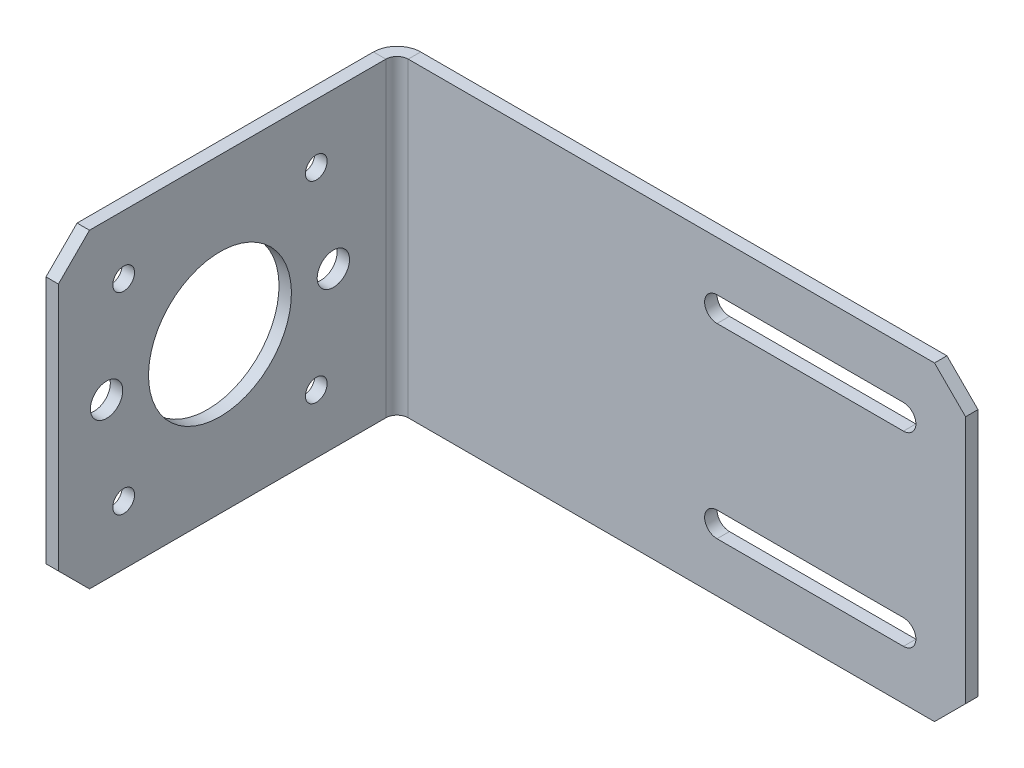
ISO-10303-21;
HEADER;
FILE_DESCRIPTION(('STEP AP214'),'2;1');
FILE_NAME('part.step','',(''),(''),'','','');
FILE_SCHEMA(('AUTOMOTIVE_DESIGN { 1 0 10303 214 1 1 1 1 }'));
ENDSEC;
DATA;
#1=APPLICATION_CONTEXT('core data for automotive mechanical design processes');
#2=APPLICATION_PROTOCOL_DEFINITION('international standard','automotive_design',2000,#1);
#3=PRODUCT_CONTEXT('',#1,'mechanical');
#4=PRODUCT('Part','Part','',(#3));
#5=PRODUCT_RELATED_PRODUCT_CATEGORY('part','',(#4));
#6=PRODUCT_DEFINITION_FORMATION('','',#4);
#7=PRODUCT_DEFINITION_CONTEXT('part definition',#1,'design');
#8=PRODUCT_DEFINITION('design','',#6,#7);
#9=PRODUCT_DEFINITION_SHAPE('','',#8);
#10=(LENGTH_UNIT() NAMED_UNIT(*) SI_UNIT(.MILLI.,.METRE.));
#11=(NAMED_UNIT(*) PLANE_ANGLE_UNIT() SI_UNIT($,.RADIAN.));
#12=(NAMED_UNIT(*) SI_UNIT($,.STERADIAN.) SOLID_ANGLE_UNIT());
#13=UNCERTAINTY_MEASURE_WITH_UNIT(LENGTH_MEASURE(1.E-05),#10,'distance_accuracy_value','');
#14=(GEOMETRIC_REPRESENTATION_CONTEXT(3) GLOBAL_UNCERTAINTY_ASSIGNED_CONTEXT((#13)) GLOBAL_UNIT_ASSIGNED_CONTEXT((#10,
#11,#12)) REPRESENTATION_CONTEXT('',''));
#15=CARTESIAN_POINT('',(0.,0.,0.));
#16=DIRECTION('',(0.,0.,1.));
#17=DIRECTION('',(1.,0.,0.));
#18=AXIS2_PLACEMENT_3D('',#15,#16,#17);
#19=CARTESIAN_POINT('',(-46.75,-25.,56.5));
#20=DIRECTION('',(0.,-1.,0.));
#21=DIRECTION('',(0.,0.,-1.));
#22=AXIS2_PLACEMENT_3D('',#19,#20,#21);
#23=PLANE('',#22);
#24=DIRECTION('',(-1.,0.,0.));
#25=VECTOR('',#24,1.);
#26=CARTESIAN_POINT('',(-46.75,-25.,3.8));
#27=LINE('',#26,#25);
#28=CARTESIAN_POINT('',(-44.75,-25.,3.8));
#29=VERTEX_POINT('',#28);
#30=CARTESIAN_POINT('',(-46.75,-25.,3.8));
#31=VERTEX_POINT('',#30);
#32=EDGE_CURVE('E11',#29,#31,#27,.T.);
#33=ORIENTED_EDGE('',*,*,#32,.F.);
#34=DIRECTION('',(0.,0.,-1.));
#35=VECTOR('',#34,1.);
#36=CARTESIAN_POINT('',(-44.75,-25.,56.5));
#37=LINE('',#36,#35);
#38=CARTESIAN_POINT('',(-44.75,-25.,51.5));
#39=VERTEX_POINT('',#38);
#40=EDGE_CURVE('E185',#39,#29,#37,.T.);
#41=ORIENTED_EDGE('',*,*,#40,.F.);
#42=DIRECTION('',(-1.,0.,0.));
#43=VECTOR('',#42,1.);
#44=CARTESIAN_POINT('',(-46.75,-25.,51.5));
#45=LINE('',#44,#43);
#46=CARTESIAN_POINT('',(-46.75,-25.,51.5));
#47=VERTEX_POINT('',#46);
#48=EDGE_CURVE('E51',#39,#47,#45,.T.);
#49=ORIENTED_EDGE('',*,*,#48,.T.);
#50=DIRECTION('',(0.,0.,-1.));
#51=VECTOR('',#50,1.);
#52=CARTESIAN_POINT('',(-46.75,-25.,56.5));
#53=LINE('',#52,#51);
#54=EDGE_CURVE('E267',#47,#31,#53,.T.);
#55=ORIENTED_EDGE('',*,*,#54,.T.);
#56=EDGE_LOOP('',(#33,#41,#49,#55));
#57=FACE_BOUND('',#56,.T.);
#58=ADVANCED_FACE('F41',(#57),#23,.T.);
#59=CARTESIAN_POINT('',(-46.75,-19.9999999999999,56.5));
#60=DIRECTION('',(0.,0.707106781186544,-0.707106781186551));
#61=DIRECTION('',(0.,0.707106781186551,0.707106781186544));
#62=AXIS2_PLACEMENT_3D('',#59,#60,#61);
#63=PLANE('',#62);
#64=ORIENTED_EDGE('',*,*,#48,.F.);
#65=DIRECTION('',(0.,0.707106781186551,0.707106781186544));
#66=VECTOR('',#65,1.);
#67=CARTESIAN_POINT('',(-44.75,-19.9999999999999,56.5));
#68=LINE('',#67,#66);
#69=CARTESIAN_POINT('',(-44.75,-19.9999999999999,56.5));
#70=VERTEX_POINT('',#69);
#71=EDGE_CURVE('E193',#39,#70,#68,.T.);
#72=ORIENTED_EDGE('',*,*,#71,.T.);
#73=DIRECTION('',(-1.,0.,0.));
#74=VECTOR('',#73,1.);
#75=CARTESIAN_POINT('',(-46.75,-19.9999999999999,56.5));
#76=LINE('',#75,#74);
#77=CARTESIAN_POINT('',(-46.75,-19.9999999999999,56.5));
#78=VERTEX_POINT('',#77);
#79=EDGE_CURVE('E261',#70,#78,#76,.T.);
#80=ORIENTED_EDGE('',*,*,#79,.T.);
#81=DIRECTION('',(0.,0.707106781186551,0.707106781186544));
#82=VECTOR('',#81,1.);
#83=CARTESIAN_POINT('',(-46.75,-19.9999999999999,56.5));
#84=LINE('',#83,#82);
#85=EDGE_CURVE('E280',#47,#78,#84,.T.);
#86=ORIENTED_EDGE('',*,*,#85,.F.);
#87=EDGE_LOOP('',(#64,#72,#80,#86));
#88=FACE_BOUND('',#87,.T.);
#89=ADVANCED_FACE('F286',(#88),#63,.F.);
#90=CARTESIAN_POINT('',(-46.75,25.,56.5));
#91=DIRECTION('',(0.,0.,1.));
#92=DIRECTION('',(0.,-1.,0.));
#93=AXIS2_PLACEMENT_3D('',#90,#91,#92);
#94=PLANE('',#93);
#95=ORIENTED_EDGE('',*,*,#79,.F.);
#96=DIRECTION('',(0.,1.,0.));
#97=VECTOR('',#96,1.);
#98=CARTESIAN_POINT('',(-44.75,25.,56.5));
#99=LINE('',#98,#97);
#100=CARTESIAN_POINT('',(-44.75,19.9999999999999,56.5));
#101=VERTEX_POINT('',#100);
#102=EDGE_CURVE('E189',#101,#70,#99,.F.);
#103=ORIENTED_EDGE('',*,*,#102,.F.);
#104=DIRECTION('',(-1.,0.,0.));
#105=VECTOR('',#104,1.);
#106=CARTESIAN_POINT('',(-46.75,19.9999999999999,56.5));
#107=LINE('',#106,#105);
#108=CARTESIAN_POINT('',(-46.75,19.9999999999999,56.5));
#109=VERTEX_POINT('',#108);
#110=EDGE_CURVE('E258',#101,#109,#107,.T.);
#111=ORIENTED_EDGE('',*,*,#110,.T.);
#112=DIRECTION('',(0.,-1.,0.));
#113=VECTOR('',#112,1.);
#114=CARTESIAN_POINT('',(-46.75,25.,56.5));
#115=LINE('',#114,#113);
#116=EDGE_CURVE('E475',#109,#78,#115,.T.);
#117=ORIENTED_EDGE('',*,*,#116,.T.);
#118=EDGE_LOOP('',(#95,#103,#111,#117));
#119=FACE_BOUND('',#118,.T.);
#120=ADVANCED_FACE('F418',(#119),#94,.T.);
#121=CARTESIAN_POINT('',(-46.75,19.9999999999999,56.5));
#122=DIRECTION('',(0.,-0.707106781186544,-0.707106781186551));
#123=DIRECTION('',(0.,0.707106781186551,-0.707106781186544));
#124=AXIS2_PLACEMENT_3D('',#121,#122,#123);
#125=PLANE('',#124);
#126=ORIENTED_EDGE('',*,*,#110,.F.);
#127=DIRECTION('',(0.,0.707106781186551,-0.707106781186544));
#128=VECTOR('',#127,1.);
#129=CARTESIAN_POINT('',(-44.75,19.9999999999999,56.5));
#130=LINE('',#129,#128);
#131=CARTESIAN_POINT('',(-44.75,25.,51.5));
#132=VERTEX_POINT('',#131);
#133=EDGE_CURVE('E186',#101,#132,#130,.T.);
#134=ORIENTED_EDGE('',*,*,#133,.T.);
#135=DIRECTION('',(-1.,0.,0.));
#136=VECTOR('',#135,1.);
#137=CARTESIAN_POINT('',(-46.75,25.,51.5));
#138=LINE('',#137,#136);
#139=CARTESIAN_POINT('',(-46.75,25.,51.5));
#140=VERTEX_POINT('',#139);
#141=EDGE_CURVE('E255',#132,#140,#138,.T.);
#142=ORIENTED_EDGE('',*,*,#141,.T.);
#143=DIRECTION('',(0.,0.707106781186551,-0.707106781186544));
#144=VECTOR('',#143,1.);
#145=CARTESIAN_POINT('',(-46.75,19.9999999999999,56.5));
#146=LINE('',#145,#144);
#147=EDGE_CURVE('E473',#109,#140,#146,.T.);
#148=ORIENTED_EDGE('',*,*,#147,.F.);
#149=EDGE_LOOP('',(#126,#134,#142,#148));
#150=FACE_BOUND('',#149,.T.);
#151=ADVANCED_FACE('F470',(#150),#125,.F.);
#152=CARTESIAN_POINT('',(-46.75,25.,56.5));
#153=DIRECTION('',(0.,-1.,0.));
#154=DIRECTION('',(0.,0.,-1.));
#155=AXIS2_PLACEMENT_3D('',#152,#153,#154);
#156=PLANE('',#155);
#157=ORIENTED_EDGE('',*,*,#141,.F.);
#158=DIRECTION('',(0.,0.,-1.));
#159=VECTOR('',#158,1.);
#160=CARTESIAN_POINT('',(-44.75,25.,56.5));
#161=LINE('',#160,#159);
#162=CARTESIAN_POINT('',(-44.75,25.,3.8));
#163=VERTEX_POINT('',#162);
#164=EDGE_CURVE('E182',#132,#163,#161,.T.);
#165=ORIENTED_EDGE('',*,*,#164,.T.);
#166=DIRECTION('',(-1.,0.,0.));
#167=VECTOR('',#166,1.);
#168=CARTESIAN_POINT('',(-46.75,25.,3.8));
#169=LINE('',#168,#167);
#170=CARTESIAN_POINT('',(-46.75,25.,3.8));
#171=VERTEX_POINT('',#170);
#172=EDGE_CURVE('E252',#163,#171,#169,.T.);
#173=ORIENTED_EDGE('',*,*,#172,.T.);
#174=DIRECTION('',(0.,0.,-1.));
#175=VECTOR('',#174,1.);
#176=CARTESIAN_POINT('',(-46.75,25.,56.5));
#177=LINE('',#176,#175);
#178=EDGE_CURVE('E284',#140,#171,#177,.T.);
#179=ORIENTED_EDGE('',*,*,#178,.F.);
#180=EDGE_LOOP('',(#157,#165,#173,#179));
#181=FACE_BOUND('',#180,.T.);
#182=ADVANCED_FACE('F411',(#181),#156,.F.);
#183=CARTESIAN_POINT('',(-42.95,25.,3.8));
#184=DIRECTION('',(0.,1.,0.));
#185=DIRECTION('',(0.,0.,1.));
#186=AXIS2_PLACEMENT_3D('',#183,#184,#185);
#187=PLANE('',#186);
#188=ORIENTED_EDGE('',*,*,#172,.F.);
#189=CARTESIAN_POINT('',(-42.95,25.,3.8));
#190=DIRECTION('',(0.,-1.,0.));
#191=DIRECTION('',(0.,0.,-1.));
#192=AXIS2_PLACEMENT_3D('',#189,#190,#191);
#193=CIRCLE('',#192,1.8);
#194=CARTESIAN_POINT('',(-42.95,25.,2.));
#195=VERTEX_POINT('',#194);
#196=EDGE_CURVE('E161',#163,#195,#193,.T.);
#197=ORIENTED_EDGE('',*,*,#196,.T.);
#198=DIRECTION('',(0.,0.,-1.));
#199=VECTOR('',#198,1.);
#200=CARTESIAN_POINT('',(-42.95,25.,0.));
#201=LINE('',#200,#199);
#202=CARTESIAN_POINT('',(-42.95,25.,0.));
#203=VERTEX_POINT('',#202);
#204=EDGE_CURVE('E59',#195,#203,#201,.T.);
#205=ORIENTED_EDGE('',*,*,#204,.T.);
#206=CARTESIAN_POINT('',(-42.95,25.,3.8));
#207=DIRECTION('',(0.,-1.,0.));
#208=DIRECTION('',(0.,0.,-1.));
#209=AXIS2_PLACEMENT_3D('',#206,#207,#208);
#210=CIRCLE('',#209,3.8);
#211=EDGE_CURVE('E332',#171,#203,#210,.T.);
#212=ORIENTED_EDGE('',*,*,#211,.F.);
#213=EDGE_LOOP('',(#188,#197,#205,#212));
#214=FACE_BOUND('',#213,.T.);
#215=ADVANCED_FACE('F404',(#214),#187,.T.);
#216=CARTESIAN_POINT('',(-46.75,25.,0.));
#217=DIRECTION('',(0.,1.,0.));
#218=DIRECTION('',(-1.,0.,0.));
#219=AXIS2_PLACEMENT_3D('',#216,#217,#218);
#220=PLANE('',#219);
#221=ORIENTED_EDGE('',*,*,#204,.F.);
#222=DIRECTION('',(1.,0.,0.));
#223=VECTOR('',#222,1.);
#224=CARTESIAN_POINT('',(0.,25.,2.));
#225=LINE('',#224,#223);
#226=CARTESIAN_POINT('',(41.75,25.,2.));
#227=VERTEX_POINT('',#226);
#228=EDGE_CURVE('E153',#227,#195,#225,.F.);
#229=ORIENTED_EDGE('',*,*,#228,.F.);
#230=DIRECTION('',(0.,0.,-1.));
#231=VECTOR('',#230,1.);
#232=CARTESIAN_POINT('',(41.75,25.,0.));
#233=LINE('',#232,#231);
#234=CARTESIAN_POINT('',(41.75,25.,0.));
#235=VERTEX_POINT('',#234);
#236=EDGE_CURVE('E248',#227,#235,#233,.T.);
#237=ORIENTED_EDGE('',*,*,#236,.T.);
#238=DIRECTION('',(-1.,0.,0.));
#239=VECTOR('',#238,1.);
#240=CARTESIAN_POINT('',(-46.75,25.,0.));
#241=LINE('',#240,#239);
#242=EDGE_CURVE('E322',#235,#203,#241,.T.);
#243=ORIENTED_EDGE('',*,*,#242,.T.);
#244=EDGE_LOOP('',(#221,#229,#237,#243));
#245=FACE_BOUND('',#244,.T.);
#246=ADVANCED_FACE('F402',(#245),#220,.T.);
#247=CARTESIAN_POINT('',(41.75,25.,0.));
#248=DIRECTION('',(0.707106781186549,0.707106781186547,0.));
#249=DIRECTION('',(-0.707106781186547,0.707106781186549,0.));
#250=AXIS2_PLACEMENT_3D('',#247,#248,#249);
#251=PLANE('',#250);
#252=ORIENTED_EDGE('',*,*,#236,.F.);
#253=DIRECTION('',(-0.707106781186547,0.707106781186549,0.));
#254=VECTOR('',#253,1.);
#255=CARTESIAN_POINT('',(41.75,25.,2.));
#256=LINE('',#255,#254);
#257=CARTESIAN_POINT('',(46.75,20.,2.));
#258=VERTEX_POINT('',#257);
#259=EDGE_CURVE('E167',#227,#258,#256,.F.);
#260=ORIENTED_EDGE('',*,*,#259,.T.);
#261=DIRECTION('',(0.,0.,-1.));
#262=VECTOR('',#261,1.);
#263=CARTESIAN_POINT('',(46.75,20.,0.));
#264=LINE('',#263,#262);
#265=CARTESIAN_POINT('',(46.75,20.,0.));
#266=VERTEX_POINT('',#265);
#267=EDGE_CURVE('E245',#258,#266,#264,.T.);
#268=ORIENTED_EDGE('',*,*,#267,.T.);
#269=DIRECTION('',(-0.707106781186547,0.707106781186549,0.));
#270=VECTOR('',#269,1.);
#271=CARTESIAN_POINT('',(41.75,25.,0.));
#272=LINE('',#271,#270);
#273=EDGE_CURVE('E325',#235,#266,#272,.F.);
#274=ORIENTED_EDGE('',*,*,#273,.F.);
#275=EDGE_LOOP('',(#252,#260,#268,#274));
#276=FACE_BOUND('',#275,.T.);
#277=ADVANCED_FACE('F400',(#276),#251,.T.);
#278=CARTESIAN_POINT('',(46.75,25.,0.));
#279=DIRECTION('',(1.,0.,0.));
#280=DIRECTION('',(0.,1.,0.));
#281=AXIS2_PLACEMENT_3D('',#278,#279,#280);
#282=PLANE('',#281);
#283=ORIENTED_EDGE('',*,*,#267,.F.);
#284=DIRECTION('',(0.,1.,0.));
#285=VECTOR('',#284,1.);
#286=CARTESIAN_POINT('',(46.75,0.,2.));
#287=LINE('',#286,#285);
#288=CARTESIAN_POINT('',(46.75,-20.,2.));
#289=VERTEX_POINT('',#288);
#290=EDGE_CURVE('E169',#289,#258,#287,.T.);
#291=ORIENTED_EDGE('',*,*,#290,.F.);
#292=DIRECTION('',(0.,0.,-1.));
#293=VECTOR('',#292,1.);
#294=CARTESIAN_POINT('',(46.75,-20.,0.));
#295=LINE('',#294,#293);
#296=CARTESIAN_POINT('',(46.75,-20.,0.));
#297=VERTEX_POINT('',#296);
#298=EDGE_CURVE('E242',#289,#297,#295,.T.);
#299=ORIENTED_EDGE('',*,*,#298,.T.);
#300=DIRECTION('',(0.,1.,0.));
#301=VECTOR('',#300,1.);
#302=CARTESIAN_POINT('',(46.75,25.,0.));
#303=LINE('',#302,#301);
#304=EDGE_CURVE('E314',#297,#266,#303,.T.);
#305=ORIENTED_EDGE('',*,*,#304,.T.);
#306=EDGE_LOOP('',(#283,#291,#299,#305));
#307=FACE_BOUND('',#306,.T.);
#308=ADVANCED_FACE('F398',(#307),#282,.T.);
#309=CARTESIAN_POINT('',(46.75,-20.,0.));
#310=DIRECTION('',(0.707106781186545,-0.70710678118655,0.));
#311=DIRECTION('',(0.70710678118655,0.707106781186545,0.));
#312=AXIS2_PLACEMENT_3D('',#309,#310,#311);
#313=PLANE('',#312);
#314=ORIENTED_EDGE('',*,*,#298,.F.);
#315=DIRECTION('',(0.70710678118655,0.707106781186545,0.));
#316=VECTOR('',#315,1.);
#317=CARTESIAN_POINT('',(46.75,-20.,2.));
#318=LINE('',#317,#316);
#319=CARTESIAN_POINT('',(41.75,-25.,2.));
#320=VERTEX_POINT('',#319);
#321=EDGE_CURVE('E165',#289,#320,#318,.F.);
#322=ORIENTED_EDGE('',*,*,#321,.T.);
#323=DIRECTION('',(0.,0.,-1.));
#324=VECTOR('',#323,1.);
#325=CARTESIAN_POINT('',(41.75,-25.,0.));
#326=LINE('',#325,#324);
#327=CARTESIAN_POINT('',(41.75,-25.,0.));
#328=VERTEX_POINT('',#327);
#329=EDGE_CURVE('E140',#320,#328,#326,.T.);
#330=ORIENTED_EDGE('',*,*,#329,.T.);
#331=DIRECTION('',(0.70710678118655,0.707106781186545,0.));
#332=VECTOR('',#331,1.);
#333=CARTESIAN_POINT('',(46.75,-20.,0.));
#334=LINE('',#333,#332);
#335=EDGE_CURVE('E317',#297,#328,#334,.F.);
#336=ORIENTED_EDGE('',*,*,#335,.F.);
#337=EDGE_LOOP('',(#314,#322,#330,#336));
#338=FACE_BOUND('',#337,.T.);
#339=ADVANCED_FACE('F395',(#338),#313,.T.);
#340=CARTESIAN_POINT('',(-46.75,-25.,0.));
#341=DIRECTION('',(0.,-1.,0.));
#342=DIRECTION('',(1.,0.,0.));
#343=AXIS2_PLACEMENT_3D('',#340,#341,#342);
#344=PLANE('',#343);
#345=ORIENTED_EDGE('',*,*,#329,.F.);
#346=DIRECTION('',(1.,0.,0.));
#347=VECTOR('',#346,1.);
#348=CARTESIAN_POINT('',(0.,-25.,2.));
#349=LINE('',#348,#347);
#350=CARTESIAN_POINT('',(-42.95,-25.,2.));
#351=VERTEX_POINT('',#350);
#352=EDGE_CURVE('E149',#351,#320,#349,.T.);
#353=ORIENTED_EDGE('',*,*,#352,.F.);
#354=DIRECTION('',(0.,0.,-1.));
#355=VECTOR('',#354,1.);
#356=CARTESIAN_POINT('',(-42.95,-25.,0.));
#357=LINE('',#356,#355);
#358=CARTESIAN_POINT('',(-42.95,-25.,0.));
#359=VERTEX_POINT('',#358);
#360=EDGE_CURVE('E45',#351,#359,#357,.T.);
#361=ORIENTED_EDGE('',*,*,#360,.T.);
#362=DIRECTION('',(1.,0.,0.));
#363=VECTOR('',#362,1.);
#364=CARTESIAN_POINT('',(-46.75,-25.,0.));
#365=LINE('',#364,#363);
#366=EDGE_CURVE('E320',#359,#328,#365,.T.);
#367=ORIENTED_EDGE('',*,*,#366,.T.);
#368=EDGE_LOOP('',(#345,#353,#361,#367));
#369=FACE_BOUND('',#368,.T.);
#370=ADVANCED_FACE('F163',(#369),#344,.T.);
#371=CARTESIAN_POINT('',(0.,13.,0.));
#372=DIRECTION('',(0.,-1.,0.));
#373=DIRECTION('',(1.,0.,0.));
#374=AXIS2_PLACEMENT_3D('',#371,#372,#373);
#375=PLANE('',#374);
#376=DIRECTION('',(0.,0.,-1.));
#377=VECTOR('',#376,1.);
#378=CARTESIAN_POINT('',(6.75000000000001,13.,0.));
#379=LINE('',#378,#377);
#380=CARTESIAN_POINT('',(6.75000000000001,13.,2.));
#381=VERTEX_POINT('',#380);
#382=CARTESIAN_POINT('',(6.75000000000001,13.,0.));
#383=VERTEX_POINT('',#382);
#384=EDGE_CURVE('E141',#381,#383,#379,.T.);
#385=ORIENTED_EDGE('',*,*,#384,.F.);
#386=DIRECTION('',(1.,0.,0.));
#387=VECTOR('',#386,1.);
#388=CARTESIAN_POINT('',(0.,13.,2.));
#389=LINE('',#388,#387);
#390=CARTESIAN_POINT('',(36.75,13.,2.));
#391=VERTEX_POINT('',#390);
#392=EDGE_CURVE('E351',#381,#391,#389,.T.);
#393=ORIENTED_EDGE('',*,*,#392,.T.);
#394=DIRECTION('',(0.,0.,-1.));
#395=VECTOR('',#394,1.);
#396=CARTESIAN_POINT('',(36.75,13.,0.));
#397=LINE('',#396,#395);
#398=CARTESIAN_POINT('',(36.75,13.,0.));
#399=VERTEX_POINT('',#398);
#400=EDGE_CURVE('E234',#391,#399,#397,.T.);
#401=ORIENTED_EDGE('',*,*,#400,.T.);
#402=DIRECTION('',(1.,0.,0.));
#403=VECTOR('',#402,1.);
#404=CARTESIAN_POINT('',(0.,13.,0.));
#405=LINE('',#404,#403);
#406=EDGE_CURVE('E308',#383,#399,#405,.T.);
#407=ORIENTED_EDGE('',*,*,#406,.F.);
#408=EDGE_LOOP('',(#385,#393,#401,#407));
#409=FACE_BOUND('',#408,.T.);
#410=ADVANCED_FACE('F551',(#409),#375,.F.);
#411=CARTESIAN_POINT('',(36.75,15.,0.));
#412=DIRECTION('',(0.,0.,1.));
#413=DIRECTION('',(1.,0.,0.));
#414=AXIS2_PLACEMENT_3D('',#411,#412,#413);
#415=CYLINDRICAL_SURFACE('',#414,2.);
#416=ORIENTED_EDGE('',*,*,#400,.F.);
#417=CARTESIAN_POINT('',(36.75,15.,2.));
#418=DIRECTION('',(0.,0.,1.));
#419=DIRECTION('',(1.,0.,0.));
#420=AXIS2_PLACEMENT_3D('',#417,#418,#419);
#421=CIRCLE('',#420,2.);
#422=CARTESIAN_POINT('',(36.75,17.,2.));
#423=VERTEX_POINT('',#422);
#424=EDGE_CURVE('E177',#391,#423,#421,.T.);
#425=ORIENTED_EDGE('',*,*,#424,.T.);
#426=DIRECTION('',(0.,0.,-1.));
#427=VECTOR('',#426,1.);
#428=CARTESIAN_POINT('',(36.75,17.,0.));
#429=LINE('',#428,#427);
#430=CARTESIAN_POINT('',(36.75,17.,0.));
#431=VERTEX_POINT('',#430);
#432=EDGE_CURVE('E231',#423,#431,#429,.T.);
#433=ORIENTED_EDGE('',*,*,#432,.T.);
#434=CARTESIAN_POINT('',(36.75,15.,0.));
#435=DIRECTION('',(0.,0.,1.));
#436=DIRECTION('',(1.,0.,0.));
#437=AXIS2_PLACEMENT_3D('',#434,#435,#436);
#438=CIRCLE('',#437,2.);
#439=EDGE_CURVE('E311',#399,#431,#438,.T.);
#440=ORIENTED_EDGE('',*,*,#439,.F.);
#441=EDGE_LOOP('',(#416,#425,#433,#440));
#442=FACE_BOUND('',#441,.T.);
#443=ADVANCED_FACE('F371',(#442),#415,.F.);
#444=CARTESIAN_POINT('',(0.,17.,0.));
#445=DIRECTION('',(0.,1.,0.));
#446=DIRECTION('',(-1.,0.,0.));
#447=AXIS2_PLACEMENT_3D('',#444,#445,#446);
#448=PLANE('',#447);
#449=ORIENTED_EDGE('',*,*,#432,.F.);
#450=DIRECTION('',(1.,0.,0.));
#451=VECTOR('',#450,1.);
#452=CARTESIAN_POINT('',(0.,17.,2.));
#453=LINE('',#452,#451);
#454=CARTESIAN_POINT('',(6.75000000000001,17.,2.));
#455=VERTEX_POINT('',#454);
#456=EDGE_CURVE('E342',#423,#455,#453,.F.);
#457=ORIENTED_EDGE('',*,*,#456,.T.);
#458=DIRECTION('',(0.,0.,-1.));
#459=VECTOR('',#458,1.);
#460=CARTESIAN_POINT('',(6.75000000000001,17.,0.));
#461=LINE('',#460,#459);
#462=CARTESIAN_POINT('',(6.75000000000001,17.,0.));
#463=VERTEX_POINT('',#462);
#464=EDGE_CURVE('E227',#455,#463,#461,.T.);
#465=ORIENTED_EDGE('',*,*,#464,.T.);
#466=DIRECTION('',(-1.,0.,0.));
#467=VECTOR('',#466,1.);
#468=CARTESIAN_POINT('',(0.,17.,0.));
#469=LINE('',#468,#467);
#470=EDGE_CURVE('E302',#431,#463,#469,.T.);
#471=ORIENTED_EDGE('',*,*,#470,.F.);
#472=EDGE_LOOP('',(#449,#457,#465,#471));
#473=FACE_BOUND('',#472,.T.);
#474=ADVANCED_FACE('F365',(#473),#448,.F.);
#475=CARTESIAN_POINT('',(0.,-17.,0.));
#476=DIRECTION('',(0.,-1.,0.));
#477=DIRECTION('',(1.,0.,0.));
#478=AXIS2_PLACEMENT_3D('',#475,#476,#477);
#479=PLANE('',#478);
#480=DIRECTION('',(0.,0.,-1.));
#481=VECTOR('',#480,1.);
#482=CARTESIAN_POINT('',(6.75000000000001,-17.,0.));
#483=LINE('',#482,#481);
#484=CARTESIAN_POINT('',(6.75000000000001,-17.,2.));
#485=VERTEX_POINT('',#484);
#486=CARTESIAN_POINT('',(6.75000000000001,-17.,0.));
#487=VERTEX_POINT('',#486);
#488=EDGE_CURVE('E224',#485,#487,#483,.T.);
#489=ORIENTED_EDGE('',*,*,#488,.F.);
#490=DIRECTION('',(1.,0.,0.));
#491=VECTOR('',#490,1.);
#492=CARTESIAN_POINT('',(0.,-17.,2.));
#493=LINE('',#492,#491);
#494=CARTESIAN_POINT('',(36.75,-17.,2.));
#495=VERTEX_POINT('',#494);
#496=EDGE_CURVE('E343',#485,#495,#493,.T.);
#497=ORIENTED_EDGE('',*,*,#496,.T.);
#498=DIRECTION('',(0.,0.,-1.));
#499=VECTOR('',#498,1.);
#500=CARTESIAN_POINT('',(36.75,-17.,0.));
#501=LINE('',#500,#499);
#502=CARTESIAN_POINT('',(36.75,-17.,0.));
#503=VERTEX_POINT('',#502);
#504=EDGE_CURVE('E220',#495,#503,#501,.T.);
#505=ORIENTED_EDGE('',*,*,#504,.T.);
#506=DIRECTION('',(1.,0.,0.));
#507=VECTOR('',#506,1.);
#508=CARTESIAN_POINT('',(0.,-17.,0.));
#509=LINE('',#508,#507);
#510=EDGE_CURVE('E296',#487,#503,#509,.T.);
#511=ORIENTED_EDGE('',*,*,#510,.F.);
#512=EDGE_LOOP('',(#489,#497,#505,#511));
#513=FACE_BOUND('',#512,.T.);
#514=ADVANCED_FACE('F579',(#513),#479,.F.);
#515=CARTESIAN_POINT('',(36.75,-15.,0.));
#516=DIRECTION('',(0.,0.,1.));
#517=DIRECTION('',(1.,0.,0.));
#518=AXIS2_PLACEMENT_3D('',#515,#516,#517);
#519=CYLINDRICAL_SURFACE('',#518,2.);
#520=ORIENTED_EDGE('',*,*,#504,.F.);
#521=CARTESIAN_POINT('',(36.75,-15.,2.));
#522=DIRECTION('',(0.,0.,1.));
#523=DIRECTION('',(1.,0.,0.));
#524=AXIS2_PLACEMENT_3D('',#521,#522,#523);
#525=CIRCLE('',#524,2.);
#526=CARTESIAN_POINT('',(36.75,-13.,2.));
#527=VERTEX_POINT('',#526);
#528=EDGE_CURVE('E339',#495,#527,#525,.T.);
#529=ORIENTED_EDGE('',*,*,#528,.T.);
#530=DIRECTION('',(0.,0.,-1.));
#531=VECTOR('',#530,1.);
#532=CARTESIAN_POINT('',(36.75,-13.,0.));
#533=LINE('',#532,#531);
#534=CARTESIAN_POINT('',(36.75,-13.,0.));
#535=VERTEX_POINT('',#534);
#536=EDGE_CURVE('E217',#527,#535,#533,.T.);
#537=ORIENTED_EDGE('',*,*,#536,.T.);
#538=CARTESIAN_POINT('',(36.75,-15.,0.));
#539=DIRECTION('',(0.,0.,1.));
#540=DIRECTION('',(1.,0.,0.));
#541=AXIS2_PLACEMENT_3D('',#538,#539,#540);
#542=CIRCLE('',#541,2.);
#543=EDGE_CURVE('E299',#503,#535,#542,.T.);
#544=ORIENTED_EDGE('',*,*,#543,.F.);
#545=EDGE_LOOP('',(#520,#529,#537,#544));
#546=FACE_BOUND('',#545,.T.);
#547=ADVANCED_FACE('F589',(#546),#519,.F.);
#548=CARTESIAN_POINT('',(0.,-13.,0.));
#549=DIRECTION('',(0.,1.,0.));
#550=DIRECTION('',(-1.,0.,0.));
#551=AXIS2_PLACEMENT_3D('',#548,#549,#550);
#552=PLANE('',#551);
#553=ORIENTED_EDGE('',*,*,#536,.F.);
#554=DIRECTION('',(1.,0.,0.));
#555=VECTOR('',#554,1.);
#556=CARTESIAN_POINT('',(0.,-13.,2.));
#557=LINE('',#556,#555);
#558=CARTESIAN_POINT('',(6.75000000000001,-13.,2.));
#559=VERTEX_POINT('',#558);
#560=EDGE_CURVE('E196',#527,#559,#557,.F.);
#561=ORIENTED_EDGE('',*,*,#560,.T.);
#562=DIRECTION('',(0.,0.,-1.));
#563=VECTOR('',#562,1.);
#564=CARTESIAN_POINT('',(6.75000000000001,-13.,0.));
#565=LINE('',#564,#563);
#566=CARTESIAN_POINT('',(6.75000000000001,-13.,0.));
#567=VERTEX_POINT('',#566);
#568=EDGE_CURVE('E221',#559,#567,#565,.T.);
#569=ORIENTED_EDGE('',*,*,#568,.T.);
#570=DIRECTION('',(-1.,0.,0.));
#571=VECTOR('',#570,1.);
#572=CARTESIAN_POINT('',(0.,-13.,0.));
#573=LINE('',#572,#571);
#574=EDGE_CURVE('E287',#535,#567,#573,.T.);
#575=ORIENTED_EDGE('',*,*,#574,.F.);
#576=EDGE_LOOP('',(#553,#561,#569,#575));
#577=FACE_BOUND('',#576,.T.);
#578=ADVANCED_FACE('F428',(#577),#552,.F.);
#579=CARTESIAN_POINT('',(-46.75,0.,48.75));
#580=DIRECTION('',(1.,0.,0.));
#581=DIRECTION('',(0.,0.,-1.));
#582=AXIS2_PLACEMENT_3D('',#579,#580,#581);
#583=CYLINDRICAL_SURFACE('',#582,2.6);
#584=CARTESIAN_POINT('',(-46.75,0.,48.75));
#585=DIRECTION('',(1.,0.,0.));
#586=DIRECTION('',(0.,0.,-1.));
#587=AXIS2_PLACEMENT_3D('',#584,#585,#586);
#588=CIRCLE('',#587,2.6);
#589=CARTESIAN_POINT('',(-46.75,0.,46.15));
#590=VERTEX_POINT('',#589);
#591=EDGE_CURVE('E333',#590,#590,#588,.T.);
#592=ORIENTED_EDGE('',*,*,#591,.F.);
#593=EDGE_LOOP('',(#592));
#594=FACE_BOUND('',#593,.T.);
#595=CARTESIAN_POINT('',(-44.75,0.,48.75));
#596=DIRECTION('',(1.,0.,0.));
#597=DIRECTION('',(0.,0.,-1.));
#598=AXIS2_PLACEMENT_3D('',#595,#596,#597);
#599=CIRCLE('',#598,2.6);
#600=CARTESIAN_POINT('',(-44.75,0.,46.15));
#601=VERTEX_POINT('',#600);
#602=EDGE_CURVE('E181',#601,#601,#599,.T.);
#603=ORIENTED_EDGE('',*,*,#602,.T.);
#604=EDGE_LOOP('',(#603));
#605=FACE_BOUND('',#604,.T.);
#606=ADVANCED_FACE('F424',(#594,#605),#583,.F.);
#607=CARTESIAN_POINT('',(-46.75,0.,12.25));
#608=DIRECTION('',(1.,0.,0.));
#609=DIRECTION('',(0.,0.,-1.));
#610=AXIS2_PLACEMENT_3D('',#607,#608,#609);
#611=CYLINDRICAL_SURFACE('',#610,2.6);
#612=CARTESIAN_POINT('',(-46.75,0.,12.25));
#613=DIRECTION('',(1.,0.,0.));
#614=DIRECTION('',(0.,0.,-1.));
#615=AXIS2_PLACEMENT_3D('',#612,#613,#614);
#616=CIRCLE('',#615,2.6);
#617=CARTESIAN_POINT('',(-46.75,0.,9.65));
#618=VERTEX_POINT('',#617);
#619=EDGE_CURVE('E891',#618,#618,#616,.T.);
#620=ORIENTED_EDGE('',*,*,#619,.F.);
#621=EDGE_LOOP('',(#620));
#622=FACE_BOUND('',#621,.T.);
#623=CARTESIAN_POINT('',(-44.75,0.,12.25));
#624=DIRECTION('',(1.,0.,0.));
#625=DIRECTION('',(0.,0.,-1.));
#626=AXIS2_PLACEMENT_3D('',#623,#624,#625);
#627=CIRCLE('',#626,2.6);
#628=CARTESIAN_POINT('',(-44.75,0.,9.65));
#629=VERTEX_POINT('',#628);
#630=EDGE_CURVE('E200',#629,#629,#627,.T.);
#631=ORIENTED_EDGE('',*,*,#630,.T.);
#632=EDGE_LOOP('',(#631));
#633=FACE_BOUND('',#632,.T.);
#634=ADVANCED_FACE('F427',(#622,#633),#611,.F.);
#635=CARTESIAN_POINT('',(-46.75,0.,30.5));
#636=DIRECTION('',(1.,0.,0.));
#637=DIRECTION('',(0.,0.,-1.));
#638=AXIS2_PLACEMENT_3D('',#635,#636,#637);
#639=CYLINDRICAL_SURFACE('',#638,11.5);
#640=CARTESIAN_POINT('',(-46.75,0.,30.5));
#641=DIRECTION('',(-1.,0.,0.));
#642=DIRECTION('',(0.,-1.,0.));
#643=AXIS2_PLACEMENT_3D('',#640,#641,#642);
#644=CIRCLE('',#643,11.5);
#645=CARTESIAN_POINT('',(-46.75,-11.5,30.5));
#646=VERTEX_POINT('',#645);
#647=EDGE_CURVE('E895',#646,#646,#644,.T.);
#648=ORIENTED_EDGE('',*,*,#647,.T.);
#649=EDGE_LOOP('',(#648));
#650=FACE_BOUND('',#649,.T.);
#651=CARTESIAN_POINT('',(-44.75,0.,30.5));
#652=DIRECTION('',(-1.,0.,0.));
#653=DIRECTION('',(0.,-1.,0.));
#654=AXIS2_PLACEMENT_3D('',#651,#652,#653);
#655=CIRCLE('',#654,11.5);
#656=CARTESIAN_POINT('',(-44.75,-11.5,30.5));
#657=VERTEX_POINT('',#656);
#658=EDGE_CURVE('E203',#657,#657,#655,.T.);
#659=ORIENTED_EDGE('',*,*,#658,.F.);
#660=EDGE_LOOP('',(#659));
#661=FACE_BOUND('',#660,.T.);
#662=ADVANCED_FACE('F432',(#650,#661),#639,.F.);
#663=CARTESIAN_POINT('',(-46.75,-15.5,15.));
#664=DIRECTION('',(1.,0.,0.));
#665=DIRECTION('',(0.,0.,-1.));
#666=AXIS2_PLACEMENT_3D('',#663,#664,#665);
#667=CYLINDRICAL_SURFACE('',#666,1.75);
#668=CARTESIAN_POINT('',(-46.75,-15.5,15.));
#669=DIRECTION('',(-1.,0.,0.));
#670=DIRECTION('',(0.,-1.,0.));
#671=AXIS2_PLACEMENT_3D('',#668,#669,#670);
#672=CIRCLE('',#671,1.75);
#673=CARTESIAN_POINT('',(-46.75,-17.25,15.));
#674=VERTEX_POINT('',#673);
#675=EDGE_CURVE('E899',#674,#674,#672,.T.);
#676=ORIENTED_EDGE('',*,*,#675,.T.);
#677=EDGE_LOOP('',(#676));
#678=FACE_BOUND('',#677,.T.);
#679=CARTESIAN_POINT('',(-44.75,-15.5,15.));
#680=DIRECTION('',(-1.,0.,0.));
#681=DIRECTION('',(0.,-1.,0.));
#682=AXIS2_PLACEMENT_3D('',#679,#680,#681);
#683=CIRCLE('',#682,1.75);
#684=CARTESIAN_POINT('',(-44.75,-17.25,15.));
#685=VERTEX_POINT('',#684);
#686=EDGE_CURVE('E206',#685,#685,#683,.T.);
#687=ORIENTED_EDGE('',*,*,#686,.F.);
#688=EDGE_LOOP('',(#687));
#689=FACE_BOUND('',#688,.T.);
#690=ADVANCED_FACE('F436',(#678,#689),#667,.F.);
#691=CARTESIAN_POINT('',(-46.75,15.5,15.));
#692=DIRECTION('',(1.,0.,0.));
#693=DIRECTION('',(0.,0.,-1.));
#694=AXIS2_PLACEMENT_3D('',#691,#692,#693);
#695=CYLINDRICAL_SURFACE('',#694,1.75);
#696=CARTESIAN_POINT('',(-46.75,15.5,15.));
#697=DIRECTION('',(-1.,0.,0.));
#698=DIRECTION('',(0.,-1.,0.));
#699=AXIS2_PLACEMENT_3D('',#696,#697,#698);
#700=CIRCLE('',#699,1.75);
#701=CARTESIAN_POINT('',(-46.75,13.75,15.));
#702=VERTEX_POINT('',#701);
#703=EDGE_CURVE('E903',#702,#702,#700,.T.);
#704=ORIENTED_EDGE('',*,*,#703,.T.);
#705=EDGE_LOOP('',(#704));
#706=FACE_BOUND('',#705,.T.);
#707=CARTESIAN_POINT('',(-44.75,15.5,15.));
#708=DIRECTION('',(-1.,0.,0.));
#709=DIRECTION('',(0.,-1.,0.));
#710=AXIS2_PLACEMENT_3D('',#707,#708,#709);
#711=CIRCLE('',#710,1.75);
#712=CARTESIAN_POINT('',(-44.75,13.75,15.));
#713=VERTEX_POINT('',#712);
#714=EDGE_CURVE('E209',#713,#713,#711,.T.);
#715=ORIENTED_EDGE('',*,*,#714,.F.);
#716=EDGE_LOOP('',(#715));
#717=FACE_BOUND('',#716,.T.);
#718=ADVANCED_FACE('F440',(#706,#717),#695,.F.);
#719=CARTESIAN_POINT('',(-46.75,-15.5,46.));
#720=DIRECTION('',(1.,0.,0.));
#721=DIRECTION('',(0.,0.,-1.));
#722=AXIS2_PLACEMENT_3D('',#719,#720,#721);
#723=CYLINDRICAL_SURFACE('',#722,1.75);
#724=CARTESIAN_POINT('',(-46.75,-15.5,46.));
#725=DIRECTION('',(-1.,0.,0.));
#726=DIRECTION('',(0.,-1.,0.));
#727=AXIS2_PLACEMENT_3D('',#724,#725,#726);
#728=CIRCLE('',#727,1.75);
#729=CARTESIAN_POINT('',(-46.75,-17.25,46.));
#730=VERTEX_POINT('',#729);
#731=EDGE_CURVE('E455',#730,#730,#728,.T.);
#732=ORIENTED_EDGE('',*,*,#731,.T.);
#733=EDGE_LOOP('',(#732));
#734=FACE_BOUND('',#733,.T.);
#735=CARTESIAN_POINT('',(-44.75,-15.5,46.));
#736=DIRECTION('',(-1.,0.,0.));
#737=DIRECTION('',(0.,-1.,0.));
#738=AXIS2_PLACEMENT_3D('',#735,#736,#737);
#739=CIRCLE('',#738,1.75);
#740=CARTESIAN_POINT('',(-44.75,-17.25,46.));
#741=VERTEX_POINT('',#740);
#742=EDGE_CURVE('E212',#741,#741,#739,.T.);
#743=ORIENTED_EDGE('',*,*,#742,.F.);
#744=EDGE_LOOP('',(#743));
#745=FACE_BOUND('',#744,.T.);
#746=ADVANCED_FACE('F443',(#734,#745),#723,.F.);
#747=CARTESIAN_POINT('',(-46.75,15.5,46.));
#748=DIRECTION('',(1.,0.,0.));
#749=DIRECTION('',(0.,0.,-1.));
#750=AXIS2_PLACEMENT_3D('',#747,#748,#749);
#751=CYLINDRICAL_SURFACE('',#750,1.75);
#752=CARTESIAN_POINT('',(-46.75,15.5,46.));
#753=DIRECTION('',(-1.,0.,0.));
#754=DIRECTION('',(0.,-1.,0.));
#755=AXIS2_PLACEMENT_3D('',#752,#753,#754);
#756=CIRCLE('',#755,1.75);
#757=CARTESIAN_POINT('',(-46.75,13.75,46.));
#758=VERTEX_POINT('',#757);
#759=EDGE_CURVE('E478',#758,#758,#756,.T.);
#760=ORIENTED_EDGE('',*,*,#759,.T.);
#761=EDGE_LOOP('',(#760));
#762=FACE_BOUND('',#761,.T.);
#763=CARTESIAN_POINT('',(-44.75,15.5,46.));
#764=DIRECTION('',(-1.,0.,0.));
#765=DIRECTION('',(0.,-1.,0.));
#766=AXIS2_PLACEMENT_3D('',#763,#764,#765);
#767=CIRCLE('',#766,1.75);
#768=CARTESIAN_POINT('',(-44.75,13.75,46.));
#769=VERTEX_POINT('',#768);
#770=EDGE_CURVE('E192',#769,#769,#767,.T.);
#771=ORIENTED_EDGE('',*,*,#770,.F.);
#772=EDGE_LOOP('',(#771));
#773=FACE_BOUND('',#772,.T.);
#774=ADVANCED_FACE('F43',(#762,#773),#751,.F.);
#775=CARTESIAN_POINT('',(6.75000000000001,-15.,0.));
#776=DIRECTION('',(0.,0.,1.));
#777=DIRECTION('',(1.,0.,0.));
#778=AXIS2_PLACEMENT_3D('',#775,#776,#777);
#779=CYLINDRICAL_SURFACE('',#778,2.);
#780=CARTESIAN_POINT('',(6.75000000000001,-15.,2.));
#781=DIRECTION('',(0.,0.,1.));
#782=DIRECTION('',(1.,0.,0.));
#783=AXIS2_PLACEMENT_3D('',#780,#781,#782);
#784=CIRCLE('',#783,2.);
#785=EDGE_CURVE('E338',#559,#485,#784,.T.);
#786=ORIENTED_EDGE('',*,*,#785,.T.);
#787=ORIENTED_EDGE('',*,*,#488,.T.);
#788=CARTESIAN_POINT('',(6.75000000000001,-15.,0.));
#789=DIRECTION('',(0.,0.,1.));
#790=DIRECTION('',(1.,0.,0.));
#791=AXIS2_PLACEMENT_3D('',#788,#789,#790);
#792=CIRCLE('',#791,2.);
#793=EDGE_CURVE('E290',#567,#487,#792,.T.);
#794=ORIENTED_EDGE('',*,*,#793,.F.);
#795=ORIENTED_EDGE('',*,*,#568,.F.);
#796=EDGE_LOOP('',(#786,#787,#794,#795));
#797=FACE_BOUND('',#796,.T.);
#798=ADVANCED_FACE('F450',(#797),#779,.F.);
#799=CARTESIAN_POINT('',(6.75000000000001,15.,0.));
#800=DIRECTION('',(0.,0.,1.));
#801=DIRECTION('',(1.,0.,0.));
#802=AXIS2_PLACEMENT_3D('',#799,#800,#801);
#803=CYLINDRICAL_SURFACE('',#802,2.);
#804=CARTESIAN_POINT('',(6.75000000000001,15.,2.));
#805=DIRECTION('',(0.,0.,1.));
#806=DIRECTION('',(1.,0.,0.));
#807=AXIS2_PLACEMENT_3D('',#804,#805,#806);
#808=CIRCLE('',#807,2.);
#809=EDGE_CURVE('E172',#455,#381,#808,.T.);
#810=ORIENTED_EDGE('',*,*,#809,.T.);
#811=ORIENTED_EDGE('',*,*,#384,.T.);
#812=CARTESIAN_POINT('',(6.75000000000001,15.,0.));
#813=DIRECTION('',(0.,0.,1.));
#814=DIRECTION('',(1.,0.,0.));
#815=AXIS2_PLACEMENT_3D('',#812,#813,#814);
#816=CIRCLE('',#815,2.);
#817=EDGE_CURVE('E305',#463,#383,#816,.T.);
#818=ORIENTED_EDGE('',*,*,#817,.F.);
#819=ORIENTED_EDGE('',*,*,#464,.F.);
#820=EDGE_LOOP('',(#810,#811,#818,#819));
#821=FACE_BOUND('',#820,.T.);
#822=ADVANCED_FACE('F359',(#821),#803,.F.);
#823=CARTESIAN_POINT('',(-42.95,-25.,3.8));
#824=DIRECTION('',(0.,1.,0.));
#825=DIRECTION('',(0.,0.,1.));
#826=AXIS2_PLACEMENT_3D('',#823,#824,#825);
#827=PLANE('',#826);
#828=CARTESIAN_POINT('',(-42.95,-25.,3.8));
#829=DIRECTION('',(0.,-1.,0.));
#830=DIRECTION('',(0.,0.,-1.));
#831=AXIS2_PLACEMENT_3D('',#828,#829,#830);
#832=CIRCLE('',#831,1.8);
#833=EDGE_CURVE('E132',#351,#29,#832,.F.);
#834=ORIENTED_EDGE('',*,*,#833,.T.);
#835=ORIENTED_EDGE('',*,*,#32,.T.);
#836=CARTESIAN_POINT('',(-42.95,-25.,3.8));
#837=DIRECTION('',(0.,-1.,0.));
#838=DIRECTION('',(0.,0.,-1.));
#839=AXIS2_PLACEMENT_3D('',#836,#837,#838);
#840=CIRCLE('',#839,3.8);
#841=EDGE_CURVE('E134',#359,#31,#840,.F.);
#842=ORIENTED_EDGE('',*,*,#841,.F.);
#843=ORIENTED_EDGE('',*,*,#360,.F.);
#844=EDGE_LOOP('',(#834,#835,#842,#843));
#845=FACE_BOUND('',#844,.T.);
#846=ADVANCED_FACE('F130',(#845),#827,.F.);
#847=CARTESIAN_POINT('',(0.,0.,0.));
#848=DIRECTION('',(0.,0.,1.));
#849=DIRECTION('',(1.,0.,0.));
#850=AXIS2_PLACEMENT_3D('',#847,#848,#849);
#851=PLANE('',#850);
#852=ORIENTED_EDGE('',*,*,#574,.T.);
#853=ORIENTED_EDGE('',*,*,#793,.T.);
#854=ORIENTED_EDGE('',*,*,#510,.T.);
#855=ORIENTED_EDGE('',*,*,#543,.T.);
#856=EDGE_LOOP('',(#852,#853,#854,#855));
#857=FACE_BOUND('',#856,.T.);
#858=ORIENTED_EDGE('',*,*,#470,.T.);
#859=ORIENTED_EDGE('',*,*,#817,.T.);
#860=ORIENTED_EDGE('',*,*,#406,.T.);
#861=ORIENTED_EDGE('',*,*,#439,.T.);
#862=EDGE_LOOP('',(#858,#859,#860,#861));
#863=FACE_BOUND('',#862,.T.);
#864=ORIENTED_EDGE('',*,*,#366,.F.);
#865=DIRECTION('',(0.,-1.,0.));
#866=VECTOR('',#865,1.);
#867=CARTESIAN_POINT('',(-42.95,0.,0.));
#868=LINE('',#867,#866);
#869=EDGE_CURVE('E230',#359,#203,#868,.F.);
#870=ORIENTED_EDGE('',*,*,#869,.T.);
#871=ORIENTED_EDGE('',*,*,#242,.F.);
#872=ORIENTED_EDGE('',*,*,#273,.T.);
#873=ORIENTED_EDGE('',*,*,#304,.F.);
#874=ORIENTED_EDGE('',*,*,#335,.T.);
#875=EDGE_LOOP('',(#864,#870,#871,#872,#873,#874));
#876=FACE_BOUND('',#875,.T.);
#877=ADVANCED_FACE('F390',(#857,#863,#876),#851,.F.);
#878=CARTESIAN_POINT('',(-46.75,25.,56.5));
#879=DIRECTION('',(1.,0.,0.));
#880=DIRECTION('',(0.,0.,-1.));
#881=AXIS2_PLACEMENT_3D('',#878,#879,#880);
#882=PLANE('',#881);
#883=ORIENTED_EDGE('',*,*,#591,.T.);
#884=EDGE_LOOP('',(#883));
#885=FACE_BOUND('',#884,.T.);
#886=ORIENTED_EDGE('',*,*,#619,.T.);
#887=EDGE_LOOP('',(#886));
#888=FACE_BOUND('',#887,.T.);
#889=ORIENTED_EDGE('',*,*,#647,.F.);
#890=EDGE_LOOP('',(#889));
#891=FACE_BOUND('',#890,.T.);
#892=ORIENTED_EDGE('',*,*,#675,.F.);
#893=EDGE_LOOP('',(#892));
#894=FACE_BOUND('',#893,.T.);
#895=ORIENTED_EDGE('',*,*,#703,.F.);
#896=EDGE_LOOP('',(#895));
#897=FACE_BOUND('',#896,.T.);
#898=ORIENTED_EDGE('',*,*,#731,.F.);
#899=EDGE_LOOP('',(#898));
#900=FACE_BOUND('',#899,.T.);
#901=ORIENTED_EDGE('',*,*,#759,.F.);
#902=EDGE_LOOP('',(#901));
#903=FACE_BOUND('',#902,.T.);
#904=ORIENTED_EDGE('',*,*,#178,.T.);
#905=DIRECTION('',(0.,-1.,0.));
#906=VECTOR('',#905,1.);
#907=CARTESIAN_POINT('',(-46.75,25.,3.8));
#908=LINE('',#907,#906);
#909=EDGE_CURVE('E283',#171,#31,#908,.T.);
#910=ORIENTED_EDGE('',*,*,#909,.T.);
#911=ORIENTED_EDGE('',*,*,#54,.F.);
#912=ORIENTED_EDGE('',*,*,#85,.T.);
#913=ORIENTED_EDGE('',*,*,#116,.F.);
#914=ORIENTED_EDGE('',*,*,#147,.T.);
#915=EDGE_LOOP('',(#904,#910,#911,#912,#913,#914));
#916=FACE_BOUND('',#915,.T.);
#917=ADVANCED_FACE('F278',(#885,#888,#891,#894,#897,#900,#903,#916),#882,.F.);
#918=CARTESIAN_POINT('',(-42.95,25.,3.8));
#919=DIRECTION('',(0.,-1.,0.));
#920=DIRECTION('',(0.,0.,-1.));
#921=AXIS2_PLACEMENT_3D('',#918,#919,#920);
#922=CYLINDRICAL_SURFACE('',#921,3.8);
#923=ORIENTED_EDGE('',*,*,#211,.T.);
#924=ORIENTED_EDGE('',*,*,#869,.F.);
#925=ORIENTED_EDGE('',*,*,#841,.T.);
#926=ORIENTED_EDGE('',*,*,#909,.F.);
#927=EDGE_LOOP('',(#923,#924,#925,#926));
#928=FACE_BOUND('',#927,.T.);
#929=ADVANCED_FACE('F387',(#928),#922,.T.);
#930=CARTESIAN_POINT('',(0.,0.,2.));
#931=DIRECTION('',(0.,0.,1.));
#932=DIRECTION('',(1.,0.,0.));
#933=AXIS2_PLACEMENT_3D('',#930,#931,#932);
#934=PLANE('',#933);
#935=ORIENTED_EDGE('',*,*,#560,.F.);
#936=ORIENTED_EDGE('',*,*,#528,.F.);
#937=ORIENTED_EDGE('',*,*,#496,.F.);
#938=ORIENTED_EDGE('',*,*,#785,.F.);
#939=EDGE_LOOP('',(#935,#936,#937,#938));
#940=FACE_BOUND('',#939,.T.);
#941=ORIENTED_EDGE('',*,*,#456,.F.);
#942=ORIENTED_EDGE('',*,*,#424,.F.);
#943=ORIENTED_EDGE('',*,*,#392,.F.);
#944=ORIENTED_EDGE('',*,*,#809,.F.);
#945=EDGE_LOOP('',(#941,#942,#943,#944));
#946=FACE_BOUND('',#945,.T.);
#947=ORIENTED_EDGE('',*,*,#352,.T.);
#948=ORIENTED_EDGE('',*,*,#321,.F.);
#949=ORIENTED_EDGE('',*,*,#290,.T.);
#950=ORIENTED_EDGE('',*,*,#259,.F.);
#951=ORIENTED_EDGE('',*,*,#228,.T.);
#952=DIRECTION('',(0.,1.,0.));
#953=VECTOR('',#952,1.);
#954=CARTESIAN_POINT('',(-42.95,0.,2.));
#955=LINE('',#954,#953);
#956=EDGE_CURVE('E146',#351,#195,#955,.T.);
#957=ORIENTED_EDGE('',*,*,#956,.F.);
#958=EDGE_LOOP('',(#947,#948,#949,#950,#951,#957));
#959=FACE_BOUND('',#958,.T.);
#960=ADVANCED_FACE('F147',(#940,#946,#959),#934,.T.);
#961=CARTESIAN_POINT('',(-44.75,25.,56.5));
#962=DIRECTION('',(1.,0.,0.));
#963=DIRECTION('',(0.,0.,-1.));
#964=AXIS2_PLACEMENT_3D('',#961,#962,#963);
#965=PLANE('',#964);
#966=ORIENTED_EDGE('',*,*,#602,.F.);
#967=EDGE_LOOP('',(#966));
#968=FACE_BOUND('',#967,.T.);
#969=ORIENTED_EDGE('',*,*,#630,.F.);
#970=EDGE_LOOP('',(#969));
#971=FACE_BOUND('',#970,.T.);
#972=ORIENTED_EDGE('',*,*,#658,.T.);
#973=EDGE_LOOP('',(#972));
#974=FACE_BOUND('',#973,.T.);
#975=ORIENTED_EDGE('',*,*,#686,.T.);
#976=EDGE_LOOP('',(#975));
#977=FACE_BOUND('',#976,.T.);
#978=ORIENTED_EDGE('',*,*,#714,.T.);
#979=EDGE_LOOP('',(#978));
#980=FACE_BOUND('',#979,.T.);
#981=ORIENTED_EDGE('',*,*,#742,.T.);
#982=EDGE_LOOP('',(#981));
#983=FACE_BOUND('',#982,.T.);
#984=ORIENTED_EDGE('',*,*,#770,.T.);
#985=EDGE_LOOP('',(#984));
#986=FACE_BOUND('',#985,.T.);
#987=ORIENTED_EDGE('',*,*,#164,.F.);
#988=ORIENTED_EDGE('',*,*,#133,.F.);
#989=ORIENTED_EDGE('',*,*,#102,.T.);
#990=ORIENTED_EDGE('',*,*,#71,.F.);
#991=ORIENTED_EDGE('',*,*,#40,.T.);
#992=DIRECTION('',(0.,1.,0.));
#993=VECTOR('',#992,1.);
#994=CARTESIAN_POINT('',(-44.75,25.,3.8));
#995=LINE('',#994,#993);
#996=EDGE_CURVE('E156',#163,#29,#995,.F.);
#997=ORIENTED_EDGE('',*,*,#996,.F.);
#998=EDGE_LOOP('',(#987,#988,#989,#990,#991,#997));
#999=FACE_BOUND('',#998,.T.);
#1000=ADVANCED_FACE('F458',(#968,#971,#974,#977,#980,#983,#986,#999),#965,.T.);
#1001=CARTESIAN_POINT('',(-42.95,25.,3.8));
#1002=DIRECTION('',(0.,-1.,0.));
#1003=DIRECTION('',(0.,0.,-1.));
#1004=AXIS2_PLACEMENT_3D('',#1001,#1002,#1003);
#1005=CYLINDRICAL_SURFACE('',#1004,1.8);
#1006=ORIENTED_EDGE('',*,*,#196,.F.);
#1007=ORIENTED_EDGE('',*,*,#996,.T.);
#1008=ORIENTED_EDGE('',*,*,#833,.F.);
#1009=ORIENTED_EDGE('',*,*,#956,.T.);
#1010=EDGE_LOOP('',(#1006,#1007,#1008,#1009));
#1011=FACE_BOUND('',#1010,.T.);
#1012=ADVANCED_FACE('F158',(#1011),#1005,.F.);
#1013=CLOSED_SHELL('',(#58,#89,#120,#151,#182,#215,#246,#277,#308,#339,#370,#410,#443,#474,#514,
#547,#578,#606,#634,#662,#690,#718,#746,#774,#798,#822,#846,#877,#917,#929,#960,#1000,#1012));
#1014=MANIFOLD_SOLID_BREP('B2',#1013);
#1015=ADVANCED_BREP_SHAPE_REPRESENTATION('',(#18,#1014),#14);
#1016=SHAPE_DEFINITION_REPRESENTATION(#9,#1015);
ENDSEC;
END-ISO-10303-21;
